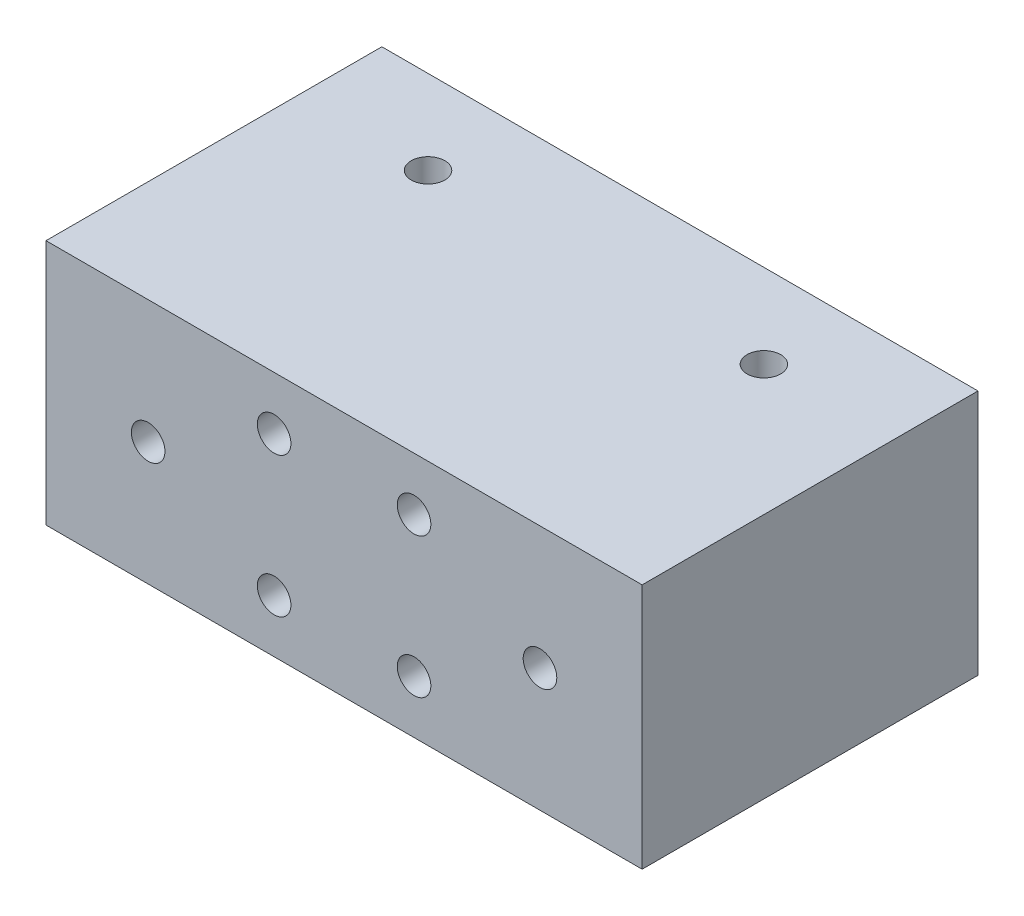
ISO-10303-21;
HEADER;
FILE_DESCRIPTION(('STEP AP214'),'2;1');
FILE_NAME('part.step','',(''),(''),'','','');
FILE_SCHEMA(('AUTOMOTIVE_DESIGN { 1 0 10303 214 1 1 1 1 }'));
ENDSEC;
DATA;
#1=APPLICATION_CONTEXT('core data for automotive mechanical design processes');
#2=APPLICATION_PROTOCOL_DEFINITION('international standard','automotive_design',2000,#1);
#3=PRODUCT_CONTEXT('',#1,'mechanical');
#4=PRODUCT('Part','Part','',(#3));
#5=PRODUCT_RELATED_PRODUCT_CATEGORY('part','',(#4));
#6=PRODUCT_DEFINITION_FORMATION('','',#4);
#7=PRODUCT_DEFINITION_CONTEXT('part definition',#1,'design');
#8=PRODUCT_DEFINITION('design','',#6,#7);
#9=PRODUCT_DEFINITION_SHAPE('','',#8);
#10=(LENGTH_UNIT() NAMED_UNIT(*) SI_UNIT(.MILLI.,.METRE.));
#11=(NAMED_UNIT(*) PLANE_ANGLE_UNIT() SI_UNIT($,.RADIAN.));
#12=(NAMED_UNIT(*) SI_UNIT($,.STERADIAN.) SOLID_ANGLE_UNIT());
#13=UNCERTAINTY_MEASURE_WITH_UNIT(LENGTH_MEASURE(1.E-05),#10,'distance_accuracy_value','');
#14=(GEOMETRIC_REPRESENTATION_CONTEXT(3) GLOBAL_UNCERTAINTY_ASSIGNED_CONTEXT((#13)) GLOBAL_UNIT_ASSIGNED_CONTEXT((#10,
#11,#12)) REPRESENTATION_CONTEXT('',''));
#15=CARTESIAN_POINT('',(0.,0.,0.));
#16=DIRECTION('',(0.,0.,1.));
#17=DIRECTION('',(1.,0.,0.));
#18=AXIS2_PLACEMENT_3D('',#15,#16,#17);
#19=CARTESIAN_POINT('',(21.3000000000001,-8.79999999999997,24.0000000000001));
#20=DIRECTION('',(-0.999999999999998,0.,0.));
#21=DIRECTION('',(0.,0.,1.));
#22=AXIS2_PLACEMENT_3D('',#19,#20,#21);
#23=PLANE('',#22);
#24=DIRECTION('',(0.,1.,0.));
#25=VECTOR('',#24,1.);
#26=CARTESIAN_POINT('',(21.3,-8.80000000000003,2.77555756156289E-13));
#27=LINE('',#26,#25);
#28=CARTESIAN_POINT('',(21.3,-8.80000000000003,2.77555756156289E-13));
#29=VERTEX_POINT('',#28);
#30=CARTESIAN_POINT('',(21.3,8.80000000000009,1.11022302462516E-13));
#31=VERTEX_POINT('',#30);
#32=EDGE_CURVE('E102',#29,#31,#27,.T.);
#33=ORIENTED_EDGE('',*,*,#32,.T.);
#34=DIRECTION('',(0.,0.,-1.));
#35=VECTOR('',#34,1.);
#36=CARTESIAN_POINT('',(21.3000000000001,8.80000000000009,24.0000000000001));
#37=LINE('',#36,#35);
#38=CARTESIAN_POINT('',(21.3000000000001,8.80000000000009,24.0000000000001));
#39=VERTEX_POINT('',#38);
#40=EDGE_CURVE('E11',#39,#31,#37,.T.);
#41=ORIENTED_EDGE('',*,*,#40,.F.);
#42=DIRECTION('',(0.,1.,0.));
#43=VECTOR('',#42,1.);
#44=CARTESIAN_POINT('',(21.3000000000001,-8.79999999999997,24.0000000000001));
#45=LINE('',#44,#43);
#46=CARTESIAN_POINT('',(21.3000000000001,-8.79999999999997,24.0000000000001));
#47=VERTEX_POINT('',#46);
#48=EDGE_CURVE('E89',#47,#39,#45,.T.);
#49=ORIENTED_EDGE('',*,*,#48,.F.);
#50=DIRECTION('',(0.,0.,-1.));
#51=VECTOR('',#50,1.);
#52=CARTESIAN_POINT('',(21.3000000000001,-8.79999999999997,24.0000000000001));
#53=LINE('',#52,#51);
#54=EDGE_CURVE('E98',#47,#29,#53,.T.);
#55=ORIENTED_EDGE('',*,*,#54,.T.);
#56=EDGE_LOOP('',(#33,#41,#49,#55));
#57=FACE_BOUND('',#56,.T.);
#58=ADVANCED_FACE('F36',(#57),#23,.F.);
#59=CARTESIAN_POINT('',(-21.2999999999999,8.80000000000009,24.0000000000002));
#60=DIRECTION('',(0.,-1.,0.));
#61=DIRECTION('',(0.,0.,-1.));
#62=AXIS2_PLACEMENT_3D('',#59,#60,#61);
#63=PLANE('',#62);
#64=CARTESIAN_POINT('',(-12.,8.79999999999997,6.00000000000017));
#65=DIRECTION('',(0.,1.,0.));
#66=DIRECTION('',(0.,0.,1.));
#67=AXIS2_PLACEMENT_3D('',#64,#65,#66);
#68=CIRCLE('',#67,1.2);
#69=CARTESIAN_POINT('',(-12.,8.79999999999997,7.20000000000017));
#70=VERTEX_POINT('',#69);
#71=EDGE_CURVE('E111',#70,#70,#68,.T.);
#72=ORIENTED_EDGE('',*,*,#71,.F.);
#73=EDGE_LOOP('',(#72));
#74=FACE_BOUND('',#73,.T.);
#75=CARTESIAN_POINT('',(12.,8.80000000000003,6.00000000000039));
#76=DIRECTION('',(0.,1.,0.));
#77=DIRECTION('',(0.,0.,1.));
#78=AXIS2_PLACEMENT_3D('',#75,#76,#77);
#79=CIRCLE('',#78,1.2);
#80=CARTESIAN_POINT('',(12.,8.80000000000003,7.2000000000004));
#81=VERTEX_POINT('',#80);
#82=EDGE_CURVE('E116',#81,#81,#79,.T.);
#83=ORIENTED_EDGE('',*,*,#82,.F.);
#84=EDGE_LOOP('',(#83));
#85=FACE_BOUND('',#84,.T.);
#86=DIRECTION('',(-0.999999999999998,0.,0.));
#87=VECTOR('',#86,1.);
#88=CARTESIAN_POINT('',(-21.3,8.80000000000003,2.77555756156289E-13));
#89=LINE('',#88,#87);
#90=CARTESIAN_POINT('',(-21.3,8.80000000000003,2.77555756156289E-13));
#91=VERTEX_POINT('',#90);
#92=EDGE_CURVE('E93',#31,#91,#89,.T.);
#93=ORIENTED_EDGE('',*,*,#92,.T.);
#94=DIRECTION('',(0.,0.,-1.));
#95=VECTOR('',#94,1.);
#96=CARTESIAN_POINT('',(-21.2999999999999,8.80000000000009,24.0000000000002));
#97=LINE('',#96,#95);
#98=CARTESIAN_POINT('',(-21.2999999999999,8.80000000000009,24.0000000000002));
#99=VERTEX_POINT('',#98);
#100=EDGE_CURVE('E45',#99,#91,#97,.T.);
#101=ORIENTED_EDGE('',*,*,#100,.F.);
#102=DIRECTION('',(-0.999999999999998,0.,0.));
#103=VECTOR('',#102,1.);
#104=CARTESIAN_POINT('',(-21.2999999999999,8.80000000000009,24.0000000000002));
#105=LINE('',#104,#103);
#106=EDGE_CURVE('E84',#39,#99,#105,.T.);
#107=ORIENTED_EDGE('',*,*,#106,.F.);
#108=ORIENTED_EDGE('',*,*,#40,.T.);
#109=EDGE_LOOP('',(#93,#101,#107,#108));
#110=FACE_BOUND('',#109,.T.);
#111=ADVANCED_FACE('F92',(#74,#85,#110),#63,.F.);
#112=CARTESIAN_POINT('',(-21.2999999999999,-8.79999999999997,24.));
#113=DIRECTION('',(0.999999999999998,0.,0.));
#114=DIRECTION('',(0.,0.,-1.));
#115=AXIS2_PLACEMENT_3D('',#112,#113,#114);
#116=PLANE('',#115);
#117=DIRECTION('',(0.,-1.,0.));
#118=VECTOR('',#117,1.);
#119=CARTESIAN_POINT('',(-21.2999999999999,-8.79999999999997,0.));
#120=LINE('',#119,#118);
#121=CARTESIAN_POINT('',(-21.2999999999999,-8.79999999999997,0.));
#122=VERTEX_POINT('',#121);
#123=EDGE_CURVE('E71',#91,#122,#120,.T.);
#124=ORIENTED_EDGE('',*,*,#123,.T.);
#125=DIRECTION('',(0.,0.,-1.));
#126=VECTOR('',#125,1.);
#127=CARTESIAN_POINT('',(-21.2999999999999,-8.79999999999997,24.));
#128=LINE('',#127,#126);
#129=CARTESIAN_POINT('',(-21.2999999999999,-8.79999999999997,24.));
#130=VERTEX_POINT('',#129);
#131=EDGE_CURVE('E94',#130,#122,#128,.T.);
#132=ORIENTED_EDGE('',*,*,#131,.F.);
#133=DIRECTION('',(0.,-1.,0.));
#134=VECTOR('',#133,1.);
#135=CARTESIAN_POINT('',(-21.2999999999999,-8.79999999999997,24.));
#136=LINE('',#135,#134);
#137=EDGE_CURVE('E87',#99,#130,#136,.T.);
#138=ORIENTED_EDGE('',*,*,#137,.F.);
#139=ORIENTED_EDGE('',*,*,#100,.T.);
#140=EDGE_LOOP('',(#124,#132,#138,#139));
#141=FACE_BOUND('',#140,.T.);
#142=ADVANCED_FACE('F96',(#141),#116,.F.);
#143=CARTESIAN_POINT('',(-21.2999999999999,-8.79999999999997,24.));
#144=DIRECTION('',(0.,1.,0.));
#145=DIRECTION('',(0.,0.,1.));
#146=AXIS2_PLACEMENT_3D('',#143,#144,#145);
#147=PLANE('',#146);
#148=CARTESIAN_POINT('',(-11.9999999999998,-8.79999999999986,6.00000000000012));
#149=DIRECTION('',(0.,1.,0.));
#150=DIRECTION('',(0.,0.,1.));
#151=AXIS2_PLACEMENT_3D('',#148,#149,#150);
#152=CIRCLE('',#151,1.2);
#153=CARTESIAN_POINT('',(-11.9999999999998,-8.79999999999986,7.20000000000012));
#154=VERTEX_POINT('',#153);
#155=EDGE_CURVE('E39',#154,#154,#152,.T.);
#156=ORIENTED_EDGE('',*,*,#155,.T.);
#157=EDGE_LOOP('',(#156));
#158=FACE_BOUND('',#157,.T.);
#159=CARTESIAN_POINT('',(12.0000000000001,-8.79999999999997,6.00000000000012));
#160=DIRECTION('',(0.,1.,0.));
#161=DIRECTION('',(0.,0.,1.));
#162=AXIS2_PLACEMENT_3D('',#159,#160,#161);
#163=CIRCLE('',#162,1.2);
#164=CARTESIAN_POINT('',(12.0000000000001,-8.79999999999997,7.20000000000012));
#165=VERTEX_POINT('',#164);
#166=EDGE_CURVE('E109',#165,#165,#163,.T.);
#167=ORIENTED_EDGE('',*,*,#166,.T.);
#168=EDGE_LOOP('',(#167));
#169=FACE_BOUND('',#168,.T.);
#170=DIRECTION('',(0.999999999999998,0.,0.));
#171=VECTOR('',#170,1.);
#172=CARTESIAN_POINT('',(-21.2999999999999,-8.79999999999997,0.));
#173=LINE('',#172,#171);
#174=EDGE_CURVE('E77',#122,#29,#173,.T.);
#175=ORIENTED_EDGE('',*,*,#174,.T.);
#176=ORIENTED_EDGE('',*,*,#54,.F.);
#177=DIRECTION('',(0.999999999999998,0.,0.));
#178=VECTOR('',#177,1.);
#179=CARTESIAN_POINT('',(-21.2999999999999,-8.79999999999997,24.));
#180=LINE('',#179,#178);
#181=EDGE_CURVE('E54',#130,#47,#180,.T.);
#182=ORIENTED_EDGE('',*,*,#181,.F.);
#183=ORIENTED_EDGE('',*,*,#131,.T.);
#184=EDGE_LOOP('',(#175,#176,#182,#183));
#185=FACE_BOUND('',#184,.T.);
#186=ADVANCED_FACE('F172',(#158,#169,#185),#147,.F.);
#187=CARTESIAN_POINT('',(0.,0.,24.0000000000002));
#188=DIRECTION('',(0.,0.,-1.));
#189=DIRECTION('',(-0.999999999999998,0.,0.));
#190=AXIS2_PLACEMENT_3D('',#187,#188,#189);
#191=PLANE('',#190);
#192=CARTESIAN_POINT('',(-14.,0.,24.0000000000003));
#193=DIRECTION('',(0.,0.,1.));
#194=DIRECTION('',(0.999999999999998,0.,0.));
#195=AXIS2_PLACEMENT_3D('',#192,#193,#194);
#196=CIRCLE('',#195,1.2);
#197=CARTESIAN_POINT('',(-12.8,0.,24.0000000000003));
#198=VERTEX_POINT('',#197);
#199=EDGE_CURVE('E149',#198,#198,#196,.T.);
#200=ORIENTED_EDGE('',*,*,#199,.F.);
#201=EDGE_LOOP('',(#200));
#202=FACE_BOUND('',#201,.T.);
#203=CARTESIAN_POINT('',(-4.99999999999987,-4.99999999999989,24.0000000000001));
#204=DIRECTION('',(0.,0.,1.));
#205=DIRECTION('',(0.999999999999998,0.,0.));
#206=AXIS2_PLACEMENT_3D('',#203,#204,#205);
#207=CIRCLE('',#206,1.2);
#208=CARTESIAN_POINT('',(-3.79999999999987,-4.99999999999989,24.0000000000001));
#209=VERTEX_POINT('',#208);
#210=EDGE_CURVE('E150',#209,#209,#207,.T.);
#211=ORIENTED_EDGE('',*,*,#210,.F.);
#212=EDGE_LOOP('',(#211));
#213=FACE_BOUND('',#212,.T.);
#214=CARTESIAN_POINT('',(5.00000000000006,-4.99999999999984,24.0000000000004));
#215=DIRECTION('',(0.,0.,1.));
#216=DIRECTION('',(0.999999999999998,0.,0.));
#217=AXIS2_PLACEMENT_3D('',#214,#215,#216);
#218=CIRCLE('',#217,1.2);
#219=CARTESIAN_POINT('',(6.20000000000006,-4.99999999999984,24.0000000000004));
#220=VERTEX_POINT('',#219);
#221=EDGE_CURVE('E124',#220,#220,#218,.T.);
#222=ORIENTED_EDGE('',*,*,#221,.F.);
#223=EDGE_LOOP('',(#222));
#224=FACE_BOUND('',#223,.T.);
#225=CARTESIAN_POINT('',(14.,2.22044604925031E-13,24.0000000000002));
#226=DIRECTION('',(0.,0.,1.));
#227=DIRECTION('',(0.999999999999998,0.,0.));
#228=AXIS2_PLACEMENT_3D('',#225,#226,#227);
#229=CIRCLE('',#228,1.2);
#230=CARTESIAN_POINT('',(15.2,2.21911378162076E-13,24.0000000000002));
#231=VERTEX_POINT('',#230);
#232=EDGE_CURVE('E131',#231,#231,#229,.T.);
#233=ORIENTED_EDGE('',*,*,#232,.F.);
#234=EDGE_LOOP('',(#233));
#235=FACE_BOUND('',#234,.T.);
#236=CARTESIAN_POINT('',(4.99999999999998,5.00000000000023,24.0000000000004));
#237=DIRECTION('',(0.,0.,1.));
#238=DIRECTION('',(0.999999999999998,0.,0.));
#239=AXIS2_PLACEMENT_3D('',#236,#237,#238);
#240=CIRCLE('',#239,1.2);
#241=CARTESIAN_POINT('',(6.19999999999997,5.00000000000023,24.0000000000004));
#242=VERTEX_POINT('',#241);
#243=EDGE_CURVE('E137',#242,#242,#240,.T.);
#244=ORIENTED_EDGE('',*,*,#243,.F.);
#245=EDGE_LOOP('',(#244));
#246=FACE_BOUND('',#245,.T.);
#247=CARTESIAN_POINT('',(-4.99999999999992,5.00000000000017,24.0000000000002));
#248=DIRECTION('',(0.,0.,1.));
#249=DIRECTION('',(0.999999999999998,0.,0.));
#250=AXIS2_PLACEMENT_3D('',#247,#248,#249);
#251=CIRCLE('',#250,1.2);
#252=CARTESIAN_POINT('',(-3.79999999999992,5.00000000000017,24.0000000000002));
#253=VERTEX_POINT('',#252);
#254=EDGE_CURVE('E143',#253,#253,#251,.T.);
#255=ORIENTED_EDGE('',*,*,#254,.F.);
#256=EDGE_LOOP('',(#255));
#257=FACE_BOUND('',#256,.T.);
#258=ORIENTED_EDGE('',*,*,#48,.T.);
#259=ORIENTED_EDGE('',*,*,#106,.T.);
#260=ORIENTED_EDGE('',*,*,#137,.T.);
#261=ORIENTED_EDGE('',*,*,#181,.T.);
#262=EDGE_LOOP('',(#258,#259,#260,#261));
#263=FACE_BOUND('',#262,.T.);
#264=ADVANCED_FACE('F85',(#202,#213,#224,#235,#246,#257,#263),#191,.F.);
#265=CARTESIAN_POINT('',(0.,0.,0.));
#266=DIRECTION('',(0.,0.,-1.));
#267=DIRECTION('',(-0.999999999999998,0.,0.));
#268=AXIS2_PLACEMENT_3D('',#265,#266,#267);
#269=PLANE('',#268);
#270=ORIENTED_EDGE('',*,*,#32,.F.);
#271=ORIENTED_EDGE('',*,*,#174,.F.);
#272=ORIENTED_EDGE('',*,*,#123,.F.);
#273=ORIENTED_EDGE('',*,*,#92,.F.);
#274=EDGE_LOOP('',(#270,#271,#272,#273));
#275=FACE_BOUND('',#274,.T.);
#276=ADVANCED_FACE('F171',(#275),#269,.T.);
#277=CARTESIAN_POINT('',(12.,-15.2000000000001,6.00000000000023));
#278=DIRECTION('',(0.,1.,0.));
#279=DIRECTION('',(0.,0.,1.));
#280=AXIS2_PLACEMENT_3D('',#277,#278,#279);
#281=CYLINDRICAL_SURFACE('',#280,1.2);
#282=ORIENTED_EDGE('',*,*,#82,.T.);
#283=EDGE_LOOP('',(#282));
#284=FACE_BOUND('',#283,.T.);
#285=ORIENTED_EDGE('',*,*,#166,.F.);
#286=EDGE_LOOP('',(#285));
#287=FACE_BOUND('',#286,.T.);
#288=ADVANCED_FACE('F197',(#284,#287),#281,.F.);
#289=CARTESIAN_POINT('',(-12.,-15.2,6.00000000000012));
#290=DIRECTION('',(0.,1.,0.));
#291=DIRECTION('',(0.,0.,1.));
#292=AXIS2_PLACEMENT_3D('',#289,#290,#291);
#293=CYLINDRICAL_SURFACE('',#292,1.2);
#294=ORIENTED_EDGE('',*,*,#71,.T.);
#295=EDGE_LOOP('',(#294));
#296=FACE_BOUND('',#295,.T.);
#297=ORIENTED_EDGE('',*,*,#155,.F.);
#298=EDGE_LOOP('',(#297));
#299=FACE_BOUND('',#298,.T.);
#300=ADVANCED_FACE('F187',(#296,#299),#293,.F.);
#301=CARTESIAN_POINT('',(-4.99999999999996,5.00000000000012,14.0000000000001));
#302=DIRECTION('',(0.,0.,1.));
#303=DIRECTION('',(0.999999999999998,0.,0.));
#304=AXIS2_PLACEMENT_3D('',#301,#302,#303);
#305=CYLINDRICAL_SURFACE('',#304,1.2);
#306=CARTESIAN_POINT('',(-4.99999999999996,5.00000000000012,14.0000000000001));
#307=DIRECTION('',(0.,0.,1.));
#308=DIRECTION('',(0.999999999999998,0.,0.));
#309=AXIS2_PLACEMENT_3D('',#306,#307,#308);
#310=CIRCLE('',#309,1.2);
#311=CARTESIAN_POINT('',(-3.79999999999997,5.00000000000012,14.0000000000001));
#312=VERTEX_POINT('',#311);
#313=EDGE_CURVE('E146',#312,#312,#310,.T.);
#314=ORIENTED_EDGE('',*,*,#313,.F.);
#315=EDGE_LOOP('',(#314));
#316=FACE_BOUND('',#315,.T.);
#317=ORIENTED_EDGE('',*,*,#254,.T.);
#318=EDGE_LOOP('',(#317));
#319=FACE_BOUND('',#318,.T.);
#320=ADVANCED_FACE('F184',(#316,#319),#305,.F.);
#321=CARTESIAN_POINT('',(-4.99999999999996,5.00000000000012,14.0000000000001));
#322=DIRECTION('',(0.,0.,1.));
#323=DIRECTION('',(0.999999999999998,0.,0.));
#324=AXIS2_PLACEMENT_3D('',#321,#322,#323);
#325=PLANE('',#324);
#326=ORIENTED_EDGE('',*,*,#313,.T.);
#327=EDGE_LOOP('',(#326));
#328=FACE_BOUND('',#327,.T.);
#329=ADVANCED_FACE('F186',(#328),#325,.T.);
#330=CARTESIAN_POINT('',(5.00000000000002,5.00000000000017,14.0000000000001));
#331=DIRECTION('',(0.,0.,1.));
#332=DIRECTION('',(0.999999999999998,0.,0.));
#333=AXIS2_PLACEMENT_3D('',#330,#331,#332);
#334=CYLINDRICAL_SURFACE('',#333,1.2);
#335=CARTESIAN_POINT('',(5.00000000000002,5.00000000000017,14.0000000000001));
#336=DIRECTION('',(0.,0.,1.));
#337=DIRECTION('',(0.999999999999998,0.,0.));
#338=AXIS2_PLACEMENT_3D('',#335,#336,#337);
#339=CIRCLE('',#338,1.2);
#340=CARTESIAN_POINT('',(6.20000000000002,5.00000000000017,14.0000000000001));
#341=VERTEX_POINT('',#340);
#342=EDGE_CURVE('E140',#341,#341,#339,.T.);
#343=ORIENTED_EDGE('',*,*,#342,.F.);
#344=EDGE_LOOP('',(#343));
#345=FACE_BOUND('',#344,.T.);
#346=ORIENTED_EDGE('',*,*,#243,.T.);
#347=EDGE_LOOP('',(#346));
#348=FACE_BOUND('',#347,.T.);
#349=ADVANCED_FACE('F194',(#345,#348),#334,.F.);
#350=CARTESIAN_POINT('',(5.00000000000002,5.00000000000017,14.0000000000001));
#351=DIRECTION('',(0.,0.,1.));
#352=DIRECTION('',(0.999999999999998,0.,0.));
#353=AXIS2_PLACEMENT_3D('',#350,#351,#352);
#354=PLANE('',#353);
#355=ORIENTED_EDGE('',*,*,#342,.T.);
#356=EDGE_LOOP('',(#355));
#357=FACE_BOUND('',#356,.T.);
#358=ADVANCED_FACE('F268',(#357),#354,.T.);
#359=CARTESIAN_POINT('',(14.0000000000001,1.11022302462516E-13,14.0000000000003));
#360=DIRECTION('',(0.,0.,1.));
#361=DIRECTION('',(0.999999999999998,0.,0.));
#362=AXIS2_PLACEMENT_3D('',#359,#360,#361);
#363=CYLINDRICAL_SURFACE('',#362,1.2);
#364=CARTESIAN_POINT('',(14.0000000000001,1.11022302462516E-13,14.0000000000003));
#365=DIRECTION('',(0.,0.,1.));
#366=DIRECTION('',(0.999999999999998,0.,0.));
#367=AXIS2_PLACEMENT_3D('',#364,#365,#366);
#368=CIRCLE('',#367,1.2);
#369=CARTESIAN_POINT('',(15.2000000000001,1.10889075699561E-13,14.0000000000003));
#370=VERTEX_POINT('',#369);
#371=EDGE_CURVE('E134',#370,#370,#368,.T.);
#372=ORIENTED_EDGE('',*,*,#371,.F.);
#373=EDGE_LOOP('',(#372));
#374=FACE_BOUND('',#373,.T.);
#375=ORIENTED_EDGE('',*,*,#232,.T.);
#376=EDGE_LOOP('',(#375));
#377=FACE_BOUND('',#376,.T.);
#378=ADVANCED_FACE('F278',(#374,#377),#363,.F.);
#379=CARTESIAN_POINT('',(14.0000000000001,1.11022302462516E-13,14.0000000000003));
#380=DIRECTION('',(0.,0.,1.));
#381=DIRECTION('',(0.999999999999998,0.,0.));
#382=AXIS2_PLACEMENT_3D('',#379,#380,#381);
#383=PLANE('',#382);
#384=ORIENTED_EDGE('',*,*,#371,.T.);
#385=EDGE_LOOP('',(#384));
#386=FACE_BOUND('',#385,.T.);
#387=ADVANCED_FACE('F287',(#386),#383,.T.);
#388=CARTESIAN_POINT('',(5.0000000000001,-5.,14.0000000000002));
#389=DIRECTION('',(0.,0.,1.));
#390=DIRECTION('',(0.999999999999998,0.,0.));
#391=AXIS2_PLACEMENT_3D('',#388,#389,#390);
#392=CYLINDRICAL_SURFACE('',#391,1.2);
#393=CARTESIAN_POINT('',(5.0000000000001,-5.,14.0000000000002));
#394=DIRECTION('',(0.,0.,1.));
#395=DIRECTION('',(0.999999999999998,0.,0.));
#396=AXIS2_PLACEMENT_3D('',#393,#394,#395);
#397=CIRCLE('',#396,1.2);
#398=CARTESIAN_POINT('',(6.2000000000001,-5.,14.0000000000002));
#399=VERTEX_POINT('',#398);
#400=EDGE_CURVE('E127',#399,#399,#397,.T.);
#401=ORIENTED_EDGE('',*,*,#400,.F.);
#402=EDGE_LOOP('',(#401));
#403=FACE_BOUND('',#402,.T.);
#404=ORIENTED_EDGE('',*,*,#221,.T.);
#405=EDGE_LOOP('',(#404));
#406=FACE_BOUND('',#405,.T.);
#407=ADVANCED_FACE('F297',(#403,#406),#392,.F.);
#408=CARTESIAN_POINT('',(5.0000000000001,-5.,14.0000000000002));
#409=DIRECTION('',(0.,0.,1.));
#410=DIRECTION('',(0.999999999999998,0.,0.));
#411=AXIS2_PLACEMENT_3D('',#408,#409,#410);
#412=PLANE('',#411);
#413=ORIENTED_EDGE('',*,*,#400,.T.);
#414=EDGE_LOOP('',(#413));
#415=FACE_BOUND('',#414,.T.);
#416=ADVANCED_FACE('F307',(#415),#412,.T.);
#417=CARTESIAN_POINT('',(-4.99999999999992,-4.99999999999984,14.0000000000002));
#418=DIRECTION('',(0.,0.,1.));
#419=DIRECTION('',(0.999999999999998,0.,0.));
#420=AXIS2_PLACEMENT_3D('',#417,#418,#419);
#421=CYLINDRICAL_SURFACE('',#420,1.2);
#422=CARTESIAN_POINT('',(-4.99999999999992,-4.99999999999984,14.0000000000002));
#423=DIRECTION('',(0.,0.,1.));
#424=DIRECTION('',(0.999999999999998,0.,0.));
#425=AXIS2_PLACEMENT_3D('',#422,#423,#424);
#426=CIRCLE('',#425,1.2);
#427=CARTESIAN_POINT('',(-3.79999999999992,-4.99999999999984,14.0000000000002));
#428=VERTEX_POINT('',#427);
#429=EDGE_CURVE('E128',#428,#428,#426,.T.);
#430=ORIENTED_EDGE('',*,*,#429,.F.);
#431=EDGE_LOOP('',(#430));
#432=FACE_BOUND('',#431,.T.);
#433=ORIENTED_EDGE('',*,*,#210,.T.);
#434=EDGE_LOOP('',(#433));
#435=FACE_BOUND('',#434,.T.);
#436=ADVANCED_FACE('F317',(#432,#435),#421,.F.);
#437=CARTESIAN_POINT('',(-4.99999999999992,-4.99999999999984,14.0000000000002));
#438=DIRECTION('',(0.,0.,1.));
#439=DIRECTION('',(0.999999999999998,0.,0.));
#440=AXIS2_PLACEMENT_3D('',#437,#438,#439);
#441=PLANE('',#440);
#442=ORIENTED_EDGE('',*,*,#429,.T.);
#443=EDGE_LOOP('',(#442));
#444=FACE_BOUND('',#443,.T.);
#445=ADVANCED_FACE('F165',(#444),#441,.T.);
#446=CARTESIAN_POINT('',(-13.9999999999999,0.,14.0000000000001));
#447=DIRECTION('',(0.,0.,1.));
#448=DIRECTION('',(0.999999999999998,0.,0.));
#449=AXIS2_PLACEMENT_3D('',#446,#447,#448);
#450=CYLINDRICAL_SURFACE('',#449,1.2);
#451=CARTESIAN_POINT('',(-13.9999999999999,0.,14.0000000000001));
#452=DIRECTION('',(0.,0.,1.));
#453=DIRECTION('',(0.999999999999998,0.,0.));
#454=AXIS2_PLACEMENT_3D('',#451,#452,#453);
#455=CIRCLE('',#454,1.2);
#456=CARTESIAN_POINT('',(-12.7999999999999,0.,14.0000000000001));
#457=VERTEX_POINT('',#456);
#458=EDGE_CURVE('E121',#457,#457,#455,.T.);
#459=ORIENTED_EDGE('',*,*,#458,.F.);
#460=EDGE_LOOP('',(#459));
#461=FACE_BOUND('',#460,.T.);
#462=ORIENTED_EDGE('',*,*,#199,.T.);
#463=EDGE_LOOP('',(#462));
#464=FACE_BOUND('',#463,.T.);
#465=ADVANCED_FACE('F162',(#461,#464),#450,.F.);
#466=CARTESIAN_POINT('',(-13.9999999999999,0.,14.0000000000001));
#467=DIRECTION('',(0.,0.,1.));
#468=DIRECTION('',(0.999999999999998,0.,0.));
#469=AXIS2_PLACEMENT_3D('',#466,#467,#468);
#470=PLANE('',#469);
#471=ORIENTED_EDGE('',*,*,#458,.T.);
#472=EDGE_LOOP('',(#471));
#473=FACE_BOUND('',#472,.T.);
#474=ADVANCED_FACE('F160',(#473),#470,.T.);
#475=CLOSED_SHELL('',(#58,#111,#142,#186,#264,#276,#288,#300,#320,#329,#349,#358,#378,#387,#407,
#416,#436,#445,#465,#474));
#476=MANIFOLD_SOLID_BREP('B2',#475);
#477=ADVANCED_BREP_SHAPE_REPRESENTATION('',(#18,#476),#14);
#478=SHAPE_DEFINITION_REPRESENTATION(#9,#477);
ENDSEC;
END-ISO-10303-21;
